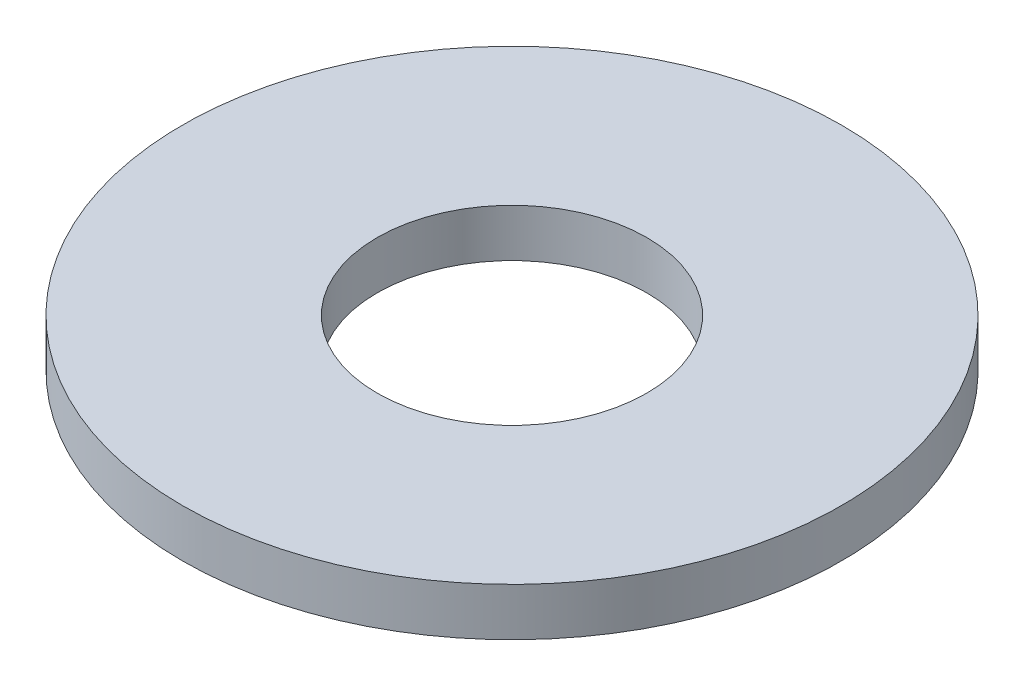
ISO-10303-21;
HEADER;
FILE_DESCRIPTION(('STEP AP214'),'2;1');
FILE_NAME('part.step','',(''),(''),'','','');
FILE_SCHEMA(('AUTOMOTIVE_DESIGN { 1 0 10303 214 1 1 1 1 }'));
ENDSEC;
DATA;
#1=APPLICATION_CONTEXT('core data for automotive mechanical design processes');
#2=APPLICATION_PROTOCOL_DEFINITION('international standard','automotive_design',2000,#1);
#3=PRODUCT_CONTEXT('',#1,'mechanical');
#4=PRODUCT('Part','Part','',(#3));
#5=PRODUCT_RELATED_PRODUCT_CATEGORY('part','',(#4));
#6=PRODUCT_DEFINITION_FORMATION('','',#4);
#7=PRODUCT_DEFINITION_CONTEXT('part definition',#1,'design');
#8=PRODUCT_DEFINITION('design','',#6,#7);
#9=PRODUCT_DEFINITION_SHAPE('','',#8);
#10=(LENGTH_UNIT() NAMED_UNIT(*) SI_UNIT(.MILLI.,.METRE.));
#11=(NAMED_UNIT(*) PLANE_ANGLE_UNIT() SI_UNIT($,.RADIAN.));
#12=(NAMED_UNIT(*) SI_UNIT($,.STERADIAN.) SOLID_ANGLE_UNIT());
#13=UNCERTAINTY_MEASURE_WITH_UNIT(LENGTH_MEASURE(1.E-05),#10,'distance_accuracy_value','');
#14=(GEOMETRIC_REPRESENTATION_CONTEXT(3) GLOBAL_UNCERTAINTY_ASSIGNED_CONTEXT((#13)) GLOBAL_UNIT_ASSIGNED_CONTEXT((#10,
#11,#12)) REPRESENTATION_CONTEXT('',''));
#15=CARTESIAN_POINT('',(0.,0.,0.));
#16=DIRECTION('',(0.,0.,1.));
#17=DIRECTION('',(1.,0.,0.));
#18=AXIS2_PLACEMENT_3D('',#15,#16,#17);
#19=CARTESIAN_POINT('',(0.,8.,0.));
#20=DIRECTION('',(0.,-1.,0.));
#21=DIRECTION('',(0.,0.,-1.));
#22=AXIS2_PLACEMENT_3D('',#19,#20,#21);
#23=CYLINDRICAL_SURFACE('',#22,55.);
#24=CARTESIAN_POINT('',(0.,8.,0.));
#25=DIRECTION('',(0.,1.,0.));
#26=DIRECTION('',(0.,0.,1.));
#27=AXIS2_PLACEMENT_3D('',#24,#25,#26);
#28=CIRCLE('',#27,55.);
#29=CARTESIAN_POINT('',(0.,8.,55.));
#30=VERTEX_POINT('',#29);
#31=EDGE_CURVE('E10',#30,#30,#28,.T.);
#32=ORIENTED_EDGE('',*,*,#31,.F.);
#33=EDGE_LOOP('',(#32));
#34=FACE_BOUND('',#33,.T.);
#35=CARTESIAN_POINT('',(0.,0.,0.));
#36=DIRECTION('',(0.,1.,0.));
#37=DIRECTION('',(0.,0.,1.));
#38=AXIS2_PLACEMENT_3D('',#35,#36,#37);
#39=CIRCLE('',#38,55.);
#40=CARTESIAN_POINT('',(0.,0.,55.));
#41=VERTEX_POINT('',#40);
#42=EDGE_CURVE('E37',#41,#41,#39,.T.);
#43=ORIENTED_EDGE('',*,*,#42,.T.);
#44=EDGE_LOOP('',(#43));
#45=FACE_BOUND('',#44,.T.);
#46=ADVANCED_FACE('F40',(#34,#45),#23,.T.);
#47=CARTESIAN_POINT('',(0.,8.,0.));
#48=DIRECTION('',(0.,1.,0.));
#49=DIRECTION('',(0.,0.,1.));
#50=AXIS2_PLACEMENT_3D('',#47,#48,#49);
#51=PLANE('',#50);
#52=CARTESIAN_POINT('',(0.,8.,0.));
#53=DIRECTION('',(0.,1.,0.));
#54=DIRECTION('',(0.,0.,1.));
#55=AXIS2_PLACEMENT_3D('',#52,#53,#54);
#56=CIRCLE('',#55,22.5);
#57=CARTESIAN_POINT('',(0.,8.,22.5));
#58=VERTEX_POINT('',#57);
#59=EDGE_CURVE('E50',#58,#58,#56,.T.);
#60=ORIENTED_EDGE('',*,*,#59,.F.);
#61=EDGE_LOOP('',(#60));
#62=FACE_BOUND('',#61,.T.);
#63=ORIENTED_EDGE('',*,*,#31,.T.);
#64=EDGE_LOOP('',(#63));
#65=FACE_BOUND('',#64,.T.);
#66=ADVANCED_FACE('F59',(#62,#65),#51,.T.);
#67=CARTESIAN_POINT('',(0.,0.,0.));
#68=DIRECTION('',(0.,1.,0.));
#69=DIRECTION('',(0.,0.,1.));
#70=AXIS2_PLACEMENT_3D('',#67,#68,#69);
#71=PLANE('',#70);
#72=CARTESIAN_POINT('',(0.,0.,0.));
#73=DIRECTION('',(0.,1.,0.));
#74=DIRECTION('',(0.,0.,1.));
#75=AXIS2_PLACEMENT_3D('',#72,#73,#74);
#76=CIRCLE('',#75,22.5);
#77=CARTESIAN_POINT('',(0.,0.,22.5));
#78=VERTEX_POINT('',#77);
#79=EDGE_CURVE('E47',#78,#78,#76,.T.);
#80=ORIENTED_EDGE('',*,*,#79,.T.);
#81=EDGE_LOOP('',(#80));
#82=FACE_BOUND('',#81,.T.);
#83=ORIENTED_EDGE('',*,*,#42,.F.);
#84=EDGE_LOOP('',(#83));
#85=FACE_BOUND('',#84,.T.);
#86=ADVANCED_FACE('F58',(#82,#85),#71,.F.);
#87=CARTESIAN_POINT('',(0.,8.,0.));
#88=DIRECTION('',(0.,-1.,0.));
#89=DIRECTION('',(0.,0.,-1.));
#90=AXIS2_PLACEMENT_3D('',#87,#88,#89);
#91=CYLINDRICAL_SURFACE('',#90,22.5);
#92=ORIENTED_EDGE('',*,*,#59,.T.);
#93=EDGE_LOOP('',(#92));
#94=FACE_BOUND('',#93,.T.);
#95=ORIENTED_EDGE('',*,*,#79,.F.);
#96=EDGE_LOOP('',(#95));
#97=FACE_BOUND('',#96,.T.);
#98=ADVANCED_FACE('F54',(#94,#97),#91,.F.);
#99=CLOSED_SHELL('',(#46,#66,#86,#98));
#100=MANIFOLD_SOLID_BREP('B2',#99);
#101=ADVANCED_BREP_SHAPE_REPRESENTATION('',(#18,#100),#14);
#102=SHAPE_DEFINITION_REPRESENTATION(#9,#101);
ENDSEC;
END-ISO-10303-21;
